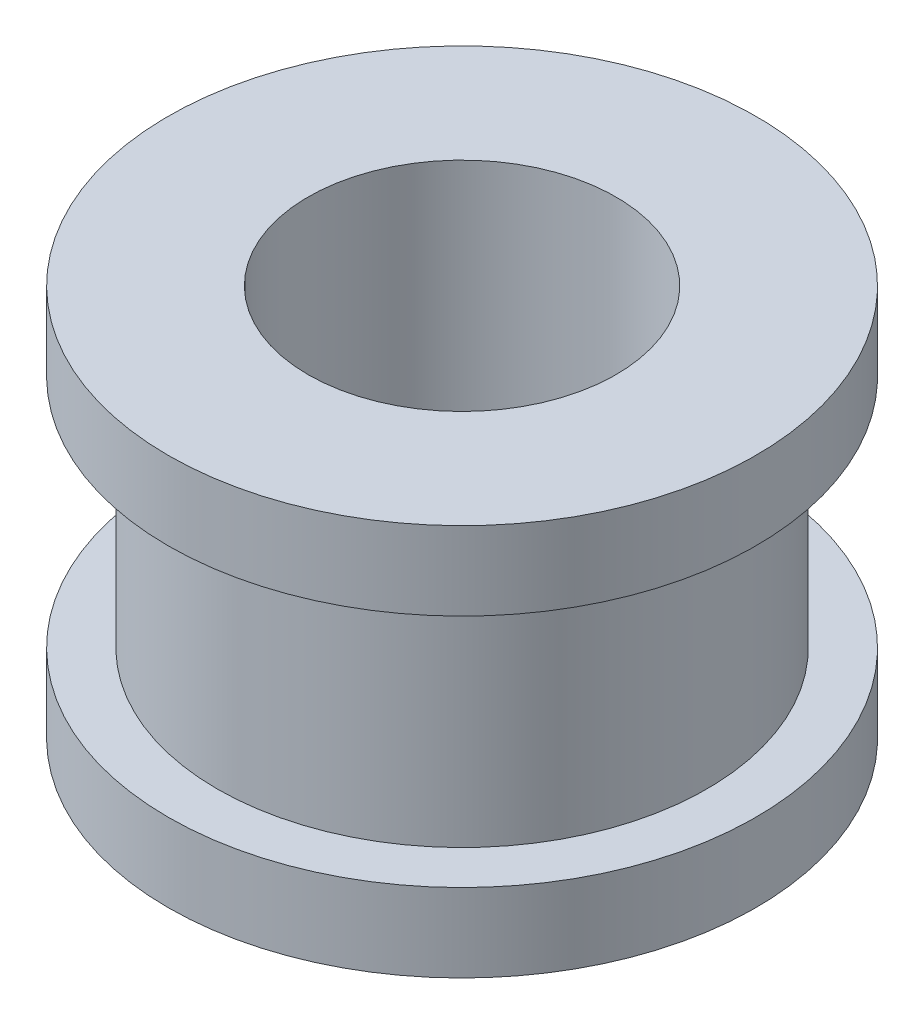
ISO-10303-21;
HEADER;
FILE_DESCRIPTION(('STEP AP214'),'2;1');
FILE_NAME('part.step','',(''),(''),'','','');
FILE_SCHEMA(('AUTOMOTIVE_DESIGN { 1 0 10303 214 1 1 1 1 }'));
ENDSEC;
DATA;
#1=APPLICATION_CONTEXT('core data for automotive mechanical design processes');
#2=APPLICATION_PROTOCOL_DEFINITION('international standard','automotive_design',2000,#1);
#3=PRODUCT_CONTEXT('',#1,'mechanical');
#4=PRODUCT('Part','Part','',(#3));
#5=PRODUCT_RELATED_PRODUCT_CATEGORY('part','',(#4));
#6=PRODUCT_DEFINITION_FORMATION('','',#4);
#7=PRODUCT_DEFINITION_CONTEXT('part definition',#1,'design');
#8=PRODUCT_DEFINITION('design','',#6,#7);
#9=PRODUCT_DEFINITION_SHAPE('','',#8);
#10=(LENGTH_UNIT() NAMED_UNIT(*) SI_UNIT(.MILLI.,.METRE.));
#11=(NAMED_UNIT(*) PLANE_ANGLE_UNIT() SI_UNIT($,.RADIAN.));
#12=(NAMED_UNIT(*) SI_UNIT($,.STERADIAN.) SOLID_ANGLE_UNIT());
#13=UNCERTAINTY_MEASURE_WITH_UNIT(LENGTH_MEASURE(1.E-05),#10,'distance_accuracy_value','');
#14=(GEOMETRIC_REPRESENTATION_CONTEXT(3) GLOBAL_UNCERTAINTY_ASSIGNED_CONTEXT((#13)) GLOBAL_UNIT_ASSIGNED_CONTEXT((#10,
#11,#12)) REPRESENTATION_CONTEXT('',''));
#15=CARTESIAN_POINT('',(0.,0.,0.));
#16=DIRECTION('',(0.,0.,1.));
#17=DIRECTION('',(1.,0.,0.));
#18=AXIS2_PLACEMENT_3D('',#15,#16,#17);
#19=CARTESIAN_POINT('',(0.,6.35,0.));
#20=DIRECTION('',(0.,-1.,0.));
#21=DIRECTION('',(0.,0.,-1.));
#22=AXIS2_PLACEMENT_3D('',#19,#20,#21);
#23=CYLINDRICAL_SURFACE('',#22,4.7625);
#24=CARTESIAN_POINT('',(0.,0.,0.));
#25=DIRECTION('',(0.,1.,0.));
#26=DIRECTION('',(0.,0.,1.));
#27=AXIS2_PLACEMENT_3D('',#24,#25,#26);
#28=CIRCLE('',#27,4.7625);
#29=CARTESIAN_POINT('',(0.,0.,4.7625));
#30=VERTEX_POINT('',#29);
#31=EDGE_CURVE('E37',#30,#30,#28,.T.);
#32=ORIENTED_EDGE('',*,*,#31,.T.);
#33=EDGE_LOOP('',(#32));
#34=FACE_BOUND('',#33,.T.);
#35=CARTESIAN_POINT('',(0.,1.27,0.));
#36=DIRECTION('',(0.,1.,0.));
#37=DIRECTION('',(0.,0.,1.));
#38=AXIS2_PLACEMENT_3D('',#35,#36,#37);
#39=CIRCLE('',#38,4.7625);
#40=CARTESIAN_POINT('',(0.,1.27,4.7625));
#41=VERTEX_POINT('',#40);
#42=EDGE_CURVE('E56',#41,#41,#39,.T.);
#43=ORIENTED_EDGE('',*,*,#42,.F.);
#44=EDGE_LOOP('',(#43));
#45=FACE_BOUND('',#44,.T.);
#46=ADVANCED_FACE('F33',(#34,#45),#23,.T.);
#47=CARTESIAN_POINT('',(0.,6.35,0.));
#48=DIRECTION('',(0.,1.,0.));
#49=DIRECTION('',(0.,0.,1.));
#50=AXIS2_PLACEMENT_3D('',#47,#48,#49);
#51=PLANE('',#50);
#52=CARTESIAN_POINT('',(0.,6.35,0.));
#53=DIRECTION('',(0.,1.,0.));
#54=DIRECTION('',(0.,0.,1.));
#55=AXIS2_PLACEMENT_3D('',#52,#53,#54);
#56=CIRCLE('',#55,4.7625);
#57=CARTESIAN_POINT('',(0.,6.35,4.7625));
#58=VERTEX_POINT('',#57);
#59=EDGE_CURVE('E11',#58,#58,#56,.T.);
#60=ORIENTED_EDGE('',*,*,#59,.T.);
#61=EDGE_LOOP('',(#60));
#62=FACE_BOUND('',#61,.T.);
#63=CARTESIAN_POINT('',(0.,6.35,0.));
#64=DIRECTION('',(0.,1.,0.));
#65=DIRECTION('',(0.,0.,1.));
#66=AXIS2_PLACEMENT_3D('',#63,#64,#65);
#67=CIRCLE('',#66,2.49555);
#68=CARTESIAN_POINT('',(0.,6.35,2.49555));
#69=VERTEX_POINT('',#68);
#70=EDGE_CURVE('E44',#69,#69,#67,.T.);
#71=ORIENTED_EDGE('',*,*,#70,.F.);
#72=EDGE_LOOP('',(#71));
#73=FACE_BOUND('',#72,.T.);
#74=ADVANCED_FACE('F78',(#62,#73),#51,.T.);
#75=CARTESIAN_POINT('',(0.,0.,0.));
#76=DIRECTION('',(0.,1.,0.));
#77=DIRECTION('',(0.,0.,1.));
#78=AXIS2_PLACEMENT_3D('',#75,#76,#77);
#79=PLANE('',#78);
#80=ORIENTED_EDGE('',*,*,#31,.F.);
#81=EDGE_LOOP('',(#80));
#82=FACE_BOUND('',#81,.T.);
#83=CARTESIAN_POINT('',(0.,0.,0.));
#84=DIRECTION('',(0.,1.,0.));
#85=DIRECTION('',(0.,0.,1.));
#86=AXIS2_PLACEMENT_3D('',#83,#84,#85);
#87=CIRCLE('',#86,2.49555);
#88=CARTESIAN_POINT('',(0.,0.,2.49555));
#89=VERTEX_POINT('',#88);
#90=EDGE_CURVE('E46',#89,#89,#87,.T.);
#91=ORIENTED_EDGE('',*,*,#90,.T.);
#92=EDGE_LOOP('',(#91));
#93=FACE_BOUND('',#92,.T.);
#94=ADVANCED_FACE('F83',(#82,#93),#79,.F.);
#95=CARTESIAN_POINT('',(0.,5.08,0.));
#96=DIRECTION('',(0.,1.,0.));
#97=DIRECTION('',(0.,0.,1.));
#98=AXIS2_PLACEMENT_3D('',#95,#96,#97);
#99=CIRCLE('',#98,4.7625);
#100=CARTESIAN_POINT('',(0.,5.08,4.7625));
#101=VERTEX_POINT('',#100);
#102=EDGE_CURVE('E49',#101,#101,#99,.T.);
#103=ORIENTED_EDGE('',*,*,#102,.T.);
#104=EDGE_LOOP('',(#103));
#105=FACE_BOUND('',#104,.T.);
#106=ORIENTED_EDGE('',*,*,#59,.F.);
#107=EDGE_LOOP('',(#106));
#108=FACE_BOUND('',#107,.T.);
#109=ADVANCED_FACE('F35',(#105,#108),#23,.T.);
#110=CARTESIAN_POINT('',(0.,6.35,0.));
#111=DIRECTION('',(0.,-1.,0.));
#112=DIRECTION('',(0.,0.,-1.));
#113=AXIS2_PLACEMENT_3D('',#110,#111,#112);
#114=CYLINDRICAL_SURFACE('',#113,2.49555);
#115=ORIENTED_EDGE('',*,*,#70,.T.);
#116=EDGE_LOOP('',(#115));
#117=FACE_BOUND('',#116,.T.);
#118=ORIENTED_EDGE('',*,*,#90,.F.);
#119=EDGE_LOOP('',(#118));
#120=FACE_BOUND('',#119,.T.);
#121=ADVANCED_FACE('F87',(#117,#120),#114,.F.);
#122=CARTESIAN_POINT('',(0.,1.27,0.));
#123=DIRECTION('',(0.,1.,0.));
#124=DIRECTION('',(0.,0.,1.));
#125=AXIS2_PLACEMENT_3D('',#122,#123,#124);
#126=PLANE('',#125);
#127=ORIENTED_EDGE('',*,*,#42,.T.);
#128=EDGE_LOOP('',(#127));
#129=FACE_BOUND('',#128,.T.);
#130=CARTESIAN_POINT('',(0.,1.27,0.));
#131=DIRECTION('',(0.,1.,0.));
#132=DIRECTION('',(0.,0.,1.));
#133=AXIS2_PLACEMENT_3D('',#130,#131,#132);
#134=CIRCLE('',#133,3.96875);
#135=CARTESIAN_POINT('',(0.,1.27,3.96875));
#136=VERTEX_POINT('',#135);
#137=EDGE_CURVE('E55',#136,#136,#134,.T.);
#138=ORIENTED_EDGE('',*,*,#137,.F.);
#139=EDGE_LOOP('',(#138));
#140=FACE_BOUND('',#139,.T.);
#141=ADVANCED_FACE('F74',(#129,#140),#126,.T.);
#142=CARTESIAN_POINT('',(0.,19.8203841816037,0.));
#143=DIRECTION('',(0.,-1.,0.));
#144=DIRECTION('',(0.,0.,-1.));
#145=AXIS2_PLACEMENT_3D('',#142,#143,#144);
#146=CYLINDRICAL_SURFACE('',#145,3.96875);
#147=ORIENTED_EDGE('',*,*,#137,.T.);
#148=EDGE_LOOP('',(#147));
#149=FACE_BOUND('',#148,.T.);
#150=CARTESIAN_POINT('',(0.,5.08,0.));
#151=DIRECTION('',(0.,1.,0.));
#152=DIRECTION('',(0.,0.,1.));
#153=AXIS2_PLACEMENT_3D('',#150,#151,#152);
#154=CIRCLE('',#153,3.96875);
#155=CARTESIAN_POINT('',(0.,5.08,3.96875));
#156=VERTEX_POINT('',#155);
#157=EDGE_CURVE('E52',#156,#156,#154,.T.);
#158=ORIENTED_EDGE('',*,*,#157,.F.);
#159=EDGE_LOOP('',(#158));
#160=FACE_BOUND('',#159,.T.);
#161=ADVANCED_FACE('F68',(#149,#160),#146,.T.);
#162=CARTESIAN_POINT('',(0.,5.08,0.));
#163=DIRECTION('',(0.,1.,0.));
#164=DIRECTION('',(0.,0.,1.));
#165=AXIS2_PLACEMENT_3D('',#162,#163,#164);
#166=PLANE('',#165);
#167=ORIENTED_EDGE('',*,*,#157,.T.);
#168=EDGE_LOOP('',(#167));
#169=FACE_BOUND('',#168,.T.);
#170=ORIENTED_EDGE('',*,*,#102,.F.);
#171=EDGE_LOOP('',(#170));
#172=FACE_BOUND('',#171,.T.);
#173=ADVANCED_FACE('F66',(#169,#172),#166,.F.);
#174=CLOSED_SHELL('',(#46,#74,#94,#109,#121,#141,#161,#173));
#175=MANIFOLD_SOLID_BREP('B2',#174);
#176=ADVANCED_BREP_SHAPE_REPRESENTATION('',(#18,#175),#14);
#177=SHAPE_DEFINITION_REPRESENTATION(#9,#176);
ENDSEC;
END-ISO-10303-21;
